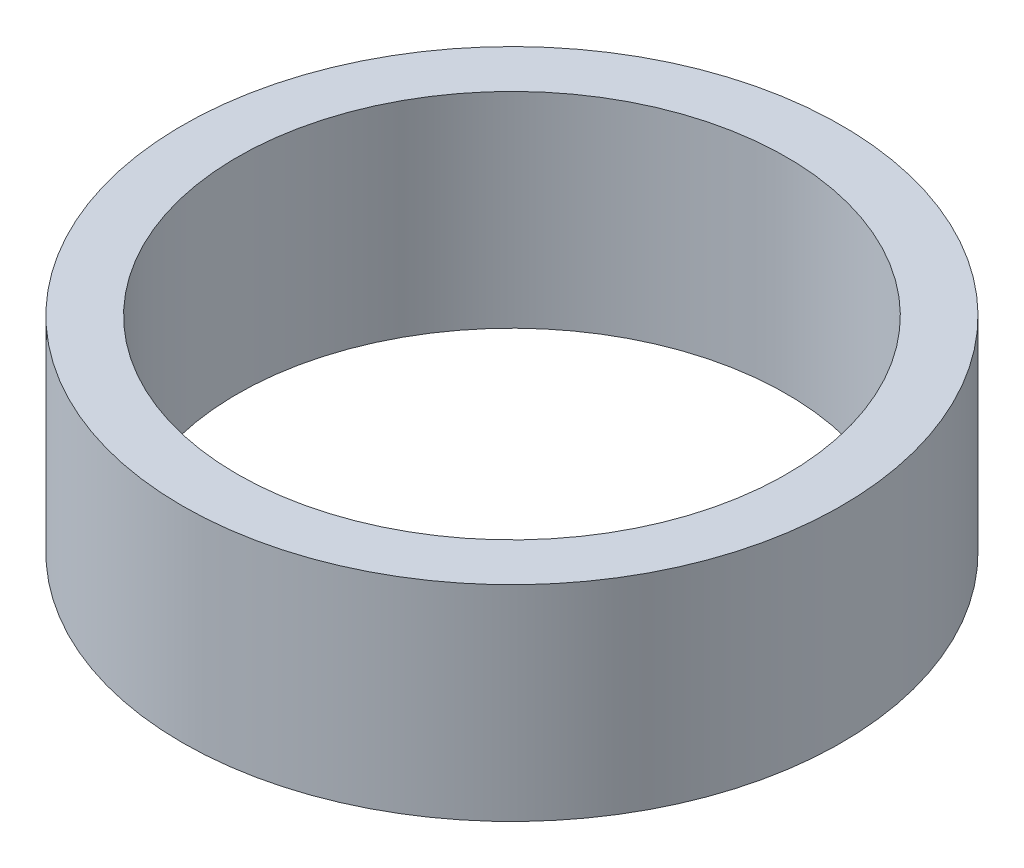
ISO-10303-21;
HEADER;
FILE_DESCRIPTION(('STEP AP214'),'2;1');
FILE_NAME('part.step','',(''),(''),'','','');
FILE_SCHEMA(('AUTOMOTIVE_DESIGN { 1 0 10303 214 1 1 1 1 }'));
ENDSEC;
DATA;
#1=APPLICATION_CONTEXT('core data for automotive mechanical design processes');
#2=APPLICATION_PROTOCOL_DEFINITION('international standard','automotive_design',2000,#1);
#3=PRODUCT_CONTEXT('',#1,'mechanical');
#4=PRODUCT('Part','Part','',(#3));
#5=PRODUCT_RELATED_PRODUCT_CATEGORY('part','',(#4));
#6=PRODUCT_DEFINITION_FORMATION('','',#4);
#7=PRODUCT_DEFINITION_CONTEXT('part definition',#1,'design');
#8=PRODUCT_DEFINITION('design','',#6,#7);
#9=PRODUCT_DEFINITION_SHAPE('','',#8);
#10=(LENGTH_UNIT() NAMED_UNIT(*) SI_UNIT(.MILLI.,.METRE.));
#11=(NAMED_UNIT(*) PLANE_ANGLE_UNIT() SI_UNIT($,.RADIAN.));
#12=(NAMED_UNIT(*) SI_UNIT($,.STERADIAN.) SOLID_ANGLE_UNIT());
#13=UNCERTAINTY_MEASURE_WITH_UNIT(LENGTH_MEASURE(1.E-05),#10,'distance_accuracy_value','');
#14=(GEOMETRIC_REPRESENTATION_CONTEXT(3) GLOBAL_UNCERTAINTY_ASSIGNED_CONTEXT((#13)) GLOBAL_UNIT_ASSIGNED_CONTEXT((#10,
#11,#12)) REPRESENTATION_CONTEXT('',''));
#15=CARTESIAN_POINT('',(0.,0.,0.));
#16=DIRECTION('',(0.,0.,1.));
#17=DIRECTION('',(1.,0.,0.));
#18=AXIS2_PLACEMENT_3D('',#15,#16,#17);
#19=CARTESIAN_POINT('',(0.,28.,0.));
#20=DIRECTION('',(0.,-1.,0.));
#21=DIRECTION('',(0.,0.,-1.));
#22=AXIS2_PLACEMENT_3D('',#19,#20,#21);
#23=CYLINDRICAL_SURFACE('',#22,45.);
#24=CARTESIAN_POINT('',(0.,28.,0.));
#25=DIRECTION('',(0.,1.,0.));
#26=DIRECTION('',(0.,0.,1.));
#27=AXIS2_PLACEMENT_3D('',#24,#25,#26);
#28=CIRCLE('',#27,45.);
#29=CARTESIAN_POINT('',(0.,28.,45.));
#30=VERTEX_POINT('',#29);
#31=EDGE_CURVE('E10',#30,#30,#28,.T.);
#32=ORIENTED_EDGE('',*,*,#31,.F.);
#33=EDGE_LOOP('',(#32));
#34=FACE_BOUND('',#33,.T.);
#35=CARTESIAN_POINT('',(0.,0.,0.));
#36=DIRECTION('',(0.,1.,0.));
#37=DIRECTION('',(0.,0.,1.));
#38=AXIS2_PLACEMENT_3D('',#35,#36,#37);
#39=CIRCLE('',#38,45.);
#40=CARTESIAN_POINT('',(0.,0.,45.));
#41=VERTEX_POINT('',#40);
#42=EDGE_CURVE('E37',#41,#41,#39,.T.);
#43=ORIENTED_EDGE('',*,*,#42,.T.);
#44=EDGE_LOOP('',(#43));
#45=FACE_BOUND('',#44,.T.);
#46=ADVANCED_FACE('F40',(#34,#45),#23,.T.);
#47=CARTESIAN_POINT('',(0.,28.,0.));
#48=DIRECTION('',(0.,1.,0.));
#49=DIRECTION('',(0.,0.,1.));
#50=AXIS2_PLACEMENT_3D('',#47,#48,#49);
#51=PLANE('',#50);
#52=CARTESIAN_POINT('',(0.,28.,0.));
#53=DIRECTION('',(0.,1.,0.));
#54=DIRECTION('',(0.,0.,1.));
#55=AXIS2_PLACEMENT_3D('',#52,#53,#54);
#56=CIRCLE('',#55,37.5);
#57=CARTESIAN_POINT('',(0.,28.,37.5));
#58=VERTEX_POINT('',#57);
#59=EDGE_CURVE('E50',#58,#58,#56,.T.);
#60=ORIENTED_EDGE('',*,*,#59,.F.);
#61=EDGE_LOOP('',(#60));
#62=FACE_BOUND('',#61,.T.);
#63=ORIENTED_EDGE('',*,*,#31,.T.);
#64=EDGE_LOOP('',(#63));
#65=FACE_BOUND('',#64,.T.);
#66=ADVANCED_FACE('F59',(#62,#65),#51,.T.);
#67=CARTESIAN_POINT('',(0.,0.,0.));
#68=DIRECTION('',(0.,1.,0.));
#69=DIRECTION('',(0.,0.,1.));
#70=AXIS2_PLACEMENT_3D('',#67,#68,#69);
#71=PLANE('',#70);
#72=CARTESIAN_POINT('',(0.,0.,0.));
#73=DIRECTION('',(0.,1.,0.));
#74=DIRECTION('',(0.,0.,1.));
#75=AXIS2_PLACEMENT_3D('',#72,#73,#74);
#76=CIRCLE('',#75,37.5);
#77=CARTESIAN_POINT('',(0.,0.,37.5));
#78=VERTEX_POINT('',#77);
#79=EDGE_CURVE('E47',#78,#78,#76,.T.);
#80=ORIENTED_EDGE('',*,*,#79,.T.);
#81=EDGE_LOOP('',(#80));
#82=FACE_BOUND('',#81,.T.);
#83=ORIENTED_EDGE('',*,*,#42,.F.);
#84=EDGE_LOOP('',(#83));
#85=FACE_BOUND('',#84,.T.);
#86=ADVANCED_FACE('F58',(#82,#85),#71,.F.);
#87=CARTESIAN_POINT('',(0.,28.,0.));
#88=DIRECTION('',(0.,-1.,0.));
#89=DIRECTION('',(0.,0.,-1.));
#90=AXIS2_PLACEMENT_3D('',#87,#88,#89);
#91=CYLINDRICAL_SURFACE('',#90,37.5);
#92=ORIENTED_EDGE('',*,*,#59,.T.);
#93=EDGE_LOOP('',(#92));
#94=FACE_BOUND('',#93,.T.);
#95=ORIENTED_EDGE('',*,*,#79,.F.);
#96=EDGE_LOOP('',(#95));
#97=FACE_BOUND('',#96,.T.);
#98=ADVANCED_FACE('F54',(#94,#97),#91,.F.);
#99=CLOSED_SHELL('',(#46,#66,#86,#98));
#100=MANIFOLD_SOLID_BREP('B2',#99);
#101=ADVANCED_BREP_SHAPE_REPRESENTATION('',(#18,#100),#14);
#102=SHAPE_DEFINITION_REPRESENTATION(#9,#101);
ENDSEC;
END-ISO-10303-21;
